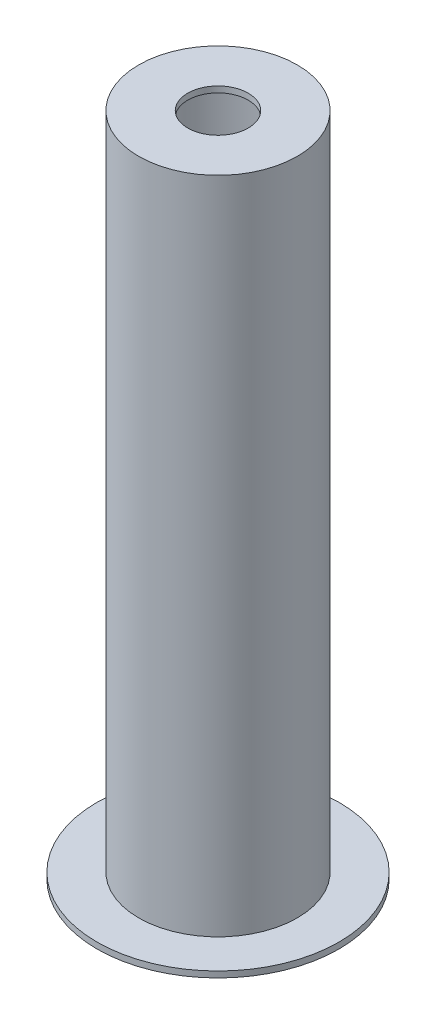
ISO-10303-21;
HEADER;
FILE_DESCRIPTION(('STEP AP214'),'2;1');
FILE_NAME('part.step','',(''),(''),'','','');
FILE_SCHEMA(('AUTOMOTIVE_DESIGN { 1 0 10303 214 1 1 1 1 }'));
ENDSEC;
DATA;
#1=APPLICATION_CONTEXT('core data for automotive mechanical design processes');
#2=APPLICATION_PROTOCOL_DEFINITION('international standard','automotive_design',2000,#1);
#3=PRODUCT_CONTEXT('',#1,'mechanical');
#4=PRODUCT('Part','Part','',(#3));
#5=PRODUCT_RELATED_PRODUCT_CATEGORY('part','',(#4));
#6=PRODUCT_DEFINITION_FORMATION('','',#4);
#7=PRODUCT_DEFINITION_CONTEXT('part definition',#1,'design');
#8=PRODUCT_DEFINITION('design','',#6,#7);
#9=PRODUCT_DEFINITION_SHAPE('','',#8);
#10=(LENGTH_UNIT() NAMED_UNIT(*) SI_UNIT(.MILLI.,.METRE.));
#11=(NAMED_UNIT(*) PLANE_ANGLE_UNIT() SI_UNIT($,.RADIAN.));
#12=(NAMED_UNIT(*) SI_UNIT($,.STERADIAN.) SOLID_ANGLE_UNIT());
#13=UNCERTAINTY_MEASURE_WITH_UNIT(LENGTH_MEASURE(1.E-05),#10,'distance_accuracy_value','');
#14=(GEOMETRIC_REPRESENTATION_CONTEXT(3) GLOBAL_UNCERTAINTY_ASSIGNED_CONTEXT((#13)) GLOBAL_UNIT_ASSIGNED_CONTEXT((#10,
#11,#12)) REPRESENTATION_CONTEXT('',''));
#15=CARTESIAN_POINT('',(0.,0.,0.));
#16=DIRECTION('',(0.,0.,1.));
#17=DIRECTION('',(1.,0.,0.));
#18=AXIS2_PLACEMENT_3D('',#15,#16,#17);
#19=CARTESIAN_POINT('',(0.,0.,0.));
#20=DIRECTION('',(0.,-1.,0.));
#21=DIRECTION('',(0.,0.,-1.));
#22=AXIS2_PLACEMENT_3D('',#19,#20,#21);
#23=CYLINDRICAL_SURFACE('',#22,50.);
#24=CARTESIAN_POINT('',(0.,1090.,0.));
#25=DIRECTION('',(0.,-1.,0.));
#26=DIRECTION('',(0.,0.,-1.));
#27=AXIS2_PLACEMENT_3D('',#24,#25,#26);
#28=CIRCLE('',#27,50.);
#29=CARTESIAN_POINT('',(0.,1090.,-50.));
#30=VERTEX_POINT('',#29);
#31=EDGE_CURVE('E67',#30,#30,#28,.T.);
#32=ORIENTED_EDGE('',*,*,#31,.T.);
#33=EDGE_LOOP('',(#32));
#34=FACE_BOUND('',#33,.T.);
#35=CARTESIAN_POINT('',(0.,1100.,0.));
#36=DIRECTION('',(0.,-1.,0.));
#37=DIRECTION('',(0.,0.,-1.));
#38=AXIS2_PLACEMENT_3D('',#35,#36,#37);
#39=CIRCLE('',#38,50.);
#40=CARTESIAN_POINT('',(0.,1100.,-50.));
#41=VERTEX_POINT('',#40);
#42=EDGE_CURVE('E10',#41,#41,#39,.T.);
#43=ORIENTED_EDGE('',*,*,#42,.F.);
#44=EDGE_LOOP('',(#43));
#45=FACE_BOUND('',#44,.T.);
#46=ADVANCED_FACE('F33',(#34,#45),#23,.F.);
#47=CARTESIAN_POINT('',(50.,1100.,0.));
#48=DIRECTION('',(0.,1.,0.));
#49=DIRECTION('',(0.,0.,1.));
#50=AXIS2_PLACEMENT_3D('',#47,#48,#49);
#51=PLANE('',#50);
#52=ORIENTED_EDGE('',*,*,#42,.T.);
#53=EDGE_LOOP('',(#52));
#54=FACE_BOUND('',#53,.T.);
#55=CARTESIAN_POINT('',(0.,1100.,0.));
#56=DIRECTION('',(0.,-1.,0.));
#57=DIRECTION('',(0.,0.,-1.));
#58=AXIS2_PLACEMENT_3D('',#55,#56,#57);
#59=CIRCLE('',#58,131.);
#60=CARTESIAN_POINT('',(0.,1100.,-131.));
#61=VERTEX_POINT('',#60);
#62=EDGE_CURVE('E39',#61,#61,#59,.T.);
#63=ORIENTED_EDGE('',*,*,#62,.F.);
#64=EDGE_LOOP('',(#63));
#65=FACE_BOUND('',#64,.T.);
#66=ADVANCED_FACE('F85',(#54,#65),#51,.T.);
#67=CARTESIAN_POINT('',(0.,0.,0.));
#68=DIRECTION('',(0.,-1.,0.));
#69=DIRECTION('',(0.,0.,-1.));
#70=AXIS2_PLACEMENT_3D('',#67,#68,#69);
#71=CYLINDRICAL_SURFACE('',#70,131.);
#72=ORIENTED_EDGE('',*,*,#62,.T.);
#73=EDGE_LOOP('',(#72));
#74=FACE_BOUND('',#73,.T.);
#75=CARTESIAN_POINT('',(0.,10.,0.));
#76=DIRECTION('',(0.,-1.,0.));
#77=DIRECTION('',(0.,0.,-1.));
#78=AXIS2_PLACEMENT_3D('',#75,#76,#77);
#79=CIRCLE('',#78,131.);
#80=CARTESIAN_POINT('',(0.,10.,-131.));
#81=VERTEX_POINT('',#80);
#82=EDGE_CURVE('E43',#81,#81,#79,.T.);
#83=ORIENTED_EDGE('',*,*,#82,.F.);
#84=EDGE_LOOP('',(#83));
#85=FACE_BOUND('',#84,.T.);
#86=ADVANCED_FACE('F89',(#74,#85),#71,.T.);
#87=CARTESIAN_POINT('',(131.,10.,0.));
#88=DIRECTION('',(0.,1.,0.));
#89=DIRECTION('',(0.,0.,1.));
#90=AXIS2_PLACEMENT_3D('',#87,#88,#89);
#91=PLANE('',#90);
#92=ORIENTED_EDGE('',*,*,#82,.T.);
#93=EDGE_LOOP('',(#92));
#94=FACE_BOUND('',#93,.T.);
#95=CARTESIAN_POINT('',(0.,10.,0.));
#96=DIRECTION('',(0.,-1.,0.));
#97=DIRECTION('',(0.,0.,-1.));
#98=AXIS2_PLACEMENT_3D('',#95,#96,#97);
#99=CIRCLE('',#98,200.);
#100=CARTESIAN_POINT('',(0.,10.,-200.));
#101=VERTEX_POINT('',#100);
#102=EDGE_CURVE('E47',#101,#101,#99,.T.);
#103=ORIENTED_EDGE('',*,*,#102,.F.);
#104=EDGE_LOOP('',(#103));
#105=FACE_BOUND('',#104,.T.);
#106=ADVANCED_FACE('F93',(#94,#105),#91,.T.);
#107=CARTESIAN_POINT('',(0.,0.,0.));
#108=DIRECTION('',(0.,-1.,0.));
#109=DIRECTION('',(0.,0.,-1.));
#110=AXIS2_PLACEMENT_3D('',#107,#108,#109);
#111=CYLINDRICAL_SURFACE('',#110,200.);
#112=ORIENTED_EDGE('',*,*,#102,.T.);
#113=EDGE_LOOP('',(#112));
#114=FACE_BOUND('',#113,.T.);
#115=CARTESIAN_POINT('',(0.,0.,0.));
#116=DIRECTION('',(0.,-1.,0.));
#117=DIRECTION('',(0.,0.,-1.));
#118=AXIS2_PLACEMENT_3D('',#115,#116,#117);
#119=CIRCLE('',#118,200.);
#120=CARTESIAN_POINT('',(0.,0.,-200.));
#121=VERTEX_POINT('',#120);
#122=EDGE_CURVE('E52',#121,#121,#119,.T.);
#123=ORIENTED_EDGE('',*,*,#122,.F.);
#124=EDGE_LOOP('',(#123));
#125=FACE_BOUND('',#124,.T.);
#126=ADVANCED_FACE('F99',(#114,#125),#111,.T.);
#127=CARTESIAN_POINT('',(119.,0.,0.));
#128=DIRECTION('',(0.,-1.,0.));
#129=DIRECTION('',(0.,0.,-1.));
#130=AXIS2_PLACEMENT_3D('',#127,#128,#129);
#131=PLANE('',#130);
#132=ORIENTED_EDGE('',*,*,#122,.T.);
#133=EDGE_LOOP('',(#132));
#134=FACE_BOUND('',#133,.T.);
#135=CARTESIAN_POINT('',(0.,0.,0.));
#136=DIRECTION('',(0.,-1.,0.));
#137=DIRECTION('',(0.,0.,-1.));
#138=AXIS2_PLACEMENT_3D('',#135,#136,#137);
#139=CIRCLE('',#138,119.);
#140=CARTESIAN_POINT('',(0.,0.,-119.));
#141=VERTEX_POINT('',#140);
#142=EDGE_CURVE('E55',#141,#141,#139,.T.);
#143=ORIENTED_EDGE('',*,*,#142,.F.);
#144=EDGE_LOOP('',(#143));
#145=FACE_BOUND('',#144,.T.);
#146=ADVANCED_FACE('F103',(#134,#145),#131,.T.);
#147=CARTESIAN_POINT('',(0.,0.,0.));
#148=DIRECTION('',(0.,-1.,0.));
#149=DIRECTION('',(0.,0.,-1.));
#150=AXIS2_PLACEMENT_3D('',#147,#148,#149);
#151=CYLINDRICAL_SURFACE('',#150,119.);
#152=ORIENTED_EDGE('',*,*,#142,.T.);
#153=EDGE_LOOP('',(#152));
#154=FACE_BOUND('',#153,.T.);
#155=CARTESIAN_POINT('',(0.,10.,0.));
#156=DIRECTION('',(0.,-1.,0.));
#157=DIRECTION('',(0.,0.,-1.));
#158=AXIS2_PLACEMENT_3D('',#155,#156,#157);
#159=CIRCLE('',#158,119.);
#160=CARTESIAN_POINT('',(0.,10.,-119.));
#161=VERTEX_POINT('',#160);
#162=EDGE_CURVE('E58',#161,#161,#159,.T.);
#163=ORIENTED_EDGE('',*,*,#162,.F.);
#164=EDGE_LOOP('',(#163));
#165=FACE_BOUND('',#164,.T.);
#166=ADVANCED_FACE('F107',(#154,#165),#151,.F.);
#167=CARTESIAN_POINT('',(125.,10.,0.));
#168=DIRECTION('',(0.,1.,0.));
#169=DIRECTION('',(0.,0.,1.));
#170=AXIS2_PLACEMENT_3D('',#167,#168,#169);
#171=PLANE('',#170);
#172=ORIENTED_EDGE('',*,*,#162,.T.);
#173=EDGE_LOOP('',(#172));
#174=FACE_BOUND('',#173,.T.);
#175=CARTESIAN_POINT('',(0.,10.,0.));
#176=DIRECTION('',(0.,-1.,0.));
#177=DIRECTION('',(0.,0.,-1.));
#178=AXIS2_PLACEMENT_3D('',#175,#176,#177);
#179=CIRCLE('',#178,125.);
#180=CARTESIAN_POINT('',(0.,10.,-125.));
#181=VERTEX_POINT('',#180);
#182=EDGE_CURVE('E61',#181,#181,#179,.T.);
#183=ORIENTED_EDGE('',*,*,#182,.F.);
#184=EDGE_LOOP('',(#183));
#185=FACE_BOUND('',#184,.T.);
#186=ADVANCED_FACE('F81',(#174,#185),#171,.T.);
#187=CARTESIAN_POINT('',(0.,0.,0.));
#188=DIRECTION('',(0.,-1.,0.));
#189=DIRECTION('',(0.,0.,-1.));
#190=AXIS2_PLACEMENT_3D('',#187,#188,#189);
#191=CYLINDRICAL_SURFACE('',#190,125.);
#192=ORIENTED_EDGE('',*,*,#182,.T.);
#193=EDGE_LOOP('',(#192));
#194=FACE_BOUND('',#193,.T.);
#195=CARTESIAN_POINT('',(0.,1090.,0.));
#196=DIRECTION('',(0.,-1.,0.));
#197=DIRECTION('',(0.,0.,-1.));
#198=AXIS2_PLACEMENT_3D('',#195,#196,#197);
#199=CIRCLE('',#198,125.);
#200=CARTESIAN_POINT('',(0.,1090.,-125.));
#201=VERTEX_POINT('',#200);
#202=EDGE_CURVE('E64',#201,#201,#199,.T.);
#203=ORIENTED_EDGE('',*,*,#202,.F.);
#204=EDGE_LOOP('',(#203));
#205=FACE_BOUND('',#204,.T.);
#206=ADVANCED_FACE('F75',(#194,#205),#191,.F.);
#207=CARTESIAN_POINT('',(125.,1090.,0.));
#208=DIRECTION('',(0.,-1.,0.));
#209=DIRECTION('',(0.,0.,-1.));
#210=AXIS2_PLACEMENT_3D('',#207,#208,#209);
#211=PLANE('',#210);
#212=ORIENTED_EDGE('',*,*,#202,.T.);
#213=EDGE_LOOP('',(#212));
#214=FACE_BOUND('',#213,.T.);
#215=ORIENTED_EDGE('',*,*,#31,.F.);
#216=EDGE_LOOP('',(#215));
#217=FACE_BOUND('',#216,.T.);
#218=ADVANCED_FACE('F73',(#214,#217),#211,.T.);
#219=CLOSED_SHELL('',(#46,#66,#86,#106,#126,#146,#166,#186,#206,#218));
#220=MANIFOLD_SOLID_BREP('B2',#219);
#221=ADVANCED_BREP_SHAPE_REPRESENTATION('',(#18,#220),#14);
#222=SHAPE_DEFINITION_REPRESENTATION(#9,#221);
ENDSEC;
END-ISO-10303-21;
